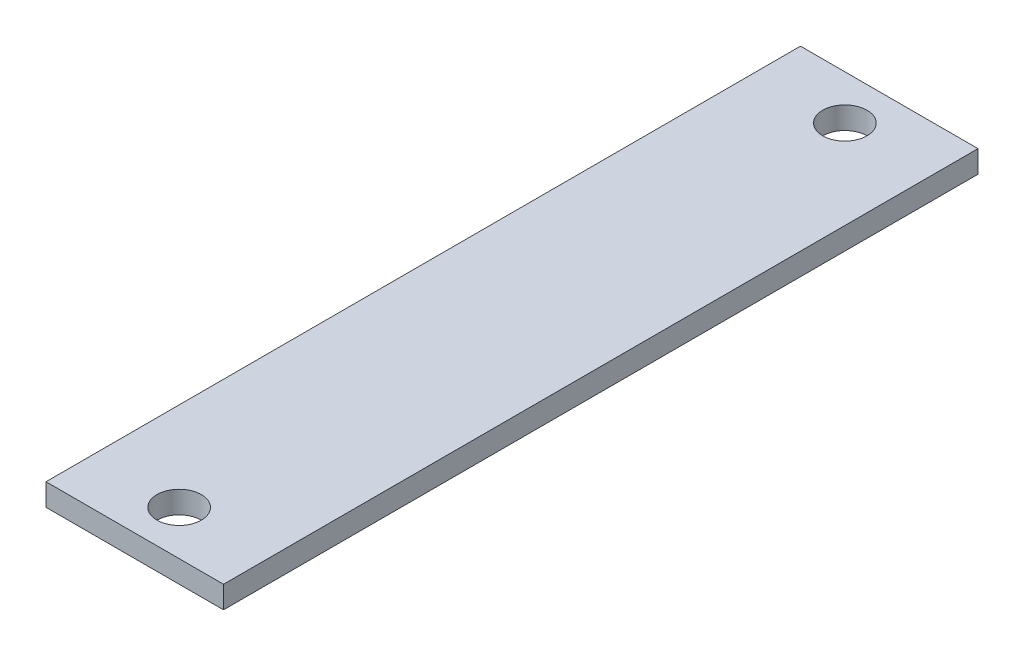
ISO-10303-21;
HEADER;
FILE_DESCRIPTION(('STEP AP214'),'2;1');
FILE_NAME('part.step','',(''),(''),'','','');
FILE_SCHEMA(('AUTOMOTIVE_DESIGN { 1 0 10303 214 1 1 1 1 }'));
ENDSEC;
DATA;
#1=APPLICATION_CONTEXT('core data for automotive mechanical design processes');
#2=APPLICATION_PROTOCOL_DEFINITION('international standard','automotive_design',2000,#1);
#3=PRODUCT_CONTEXT('',#1,'mechanical');
#4=PRODUCT('Part','Part','',(#3));
#5=PRODUCT_RELATED_PRODUCT_CATEGORY('part','',(#4));
#6=PRODUCT_DEFINITION_FORMATION('','',#4);
#7=PRODUCT_DEFINITION_CONTEXT('part definition',#1,'design');
#8=PRODUCT_DEFINITION('design','',#6,#7);
#9=PRODUCT_DEFINITION_SHAPE('','',#8);
#10=(LENGTH_UNIT() NAMED_UNIT(*) SI_UNIT(.MILLI.,.METRE.));
#11=(NAMED_UNIT(*) PLANE_ANGLE_UNIT() SI_UNIT($,.RADIAN.));
#12=(NAMED_UNIT(*) SI_UNIT($,.STERADIAN.) SOLID_ANGLE_UNIT());
#13=UNCERTAINTY_MEASURE_WITH_UNIT(LENGTH_MEASURE(1.E-05),#10,'distance_accuracy_value','');
#14=(GEOMETRIC_REPRESENTATION_CONTEXT(3) GLOBAL_UNCERTAINTY_ASSIGNED_CONTEXT((#13)) GLOBAL_UNIT_ASSIGNED_CONTEXT((#10,
#11,#12)) REPRESENTATION_CONTEXT('',''));
#15=CARTESIAN_POINT('',(0.,0.,0.));
#16=DIRECTION('',(0.,0.,1.));
#17=DIRECTION('',(1.,0.,0.));
#18=AXIS2_PLACEMENT_3D('',#15,#16,#17);
#19=CARTESIAN_POINT('',(-13.3421348080039,0.,51.6916067275177));
#20=DIRECTION('',(-1.,0.,0.));
#21=DIRECTION('',(0.,0.,1.));
#22=AXIS2_PLACEMENT_3D('',#19,#20,#21);
#23=PLANE('',#22);
#24=DIRECTION('',(0.,0.,-1.));
#25=VECTOR('',#24,1.);
#26=CARTESIAN_POINT('',(-13.3421348080039,-3.175,51.6916067275177));
#27=LINE('',#26,#25);
#28=CARTESIAN_POINT('',(-13.3421348080039,-3.175,51.6916067275177));
#29=VERTEX_POINT('',#28);
#30=CARTESIAN_POINT('',(-13.3421348080039,-3.175,-56.2583932724823));
#31=VERTEX_POINT('',#30);
#32=EDGE_CURVE('E114',#29,#31,#27,.T.);
#33=ORIENTED_EDGE('',*,*,#32,.F.);
#34=DIRECTION('',(0.,-1.,0.));
#35=VECTOR('',#34,1.);
#36=CARTESIAN_POINT('',(-13.3421348080039,0.,51.6916067275177));
#37=LINE('',#36,#35);
#38=CARTESIAN_POINT('',(-13.3421348080039,0.,51.6916067275177));
#39=VERTEX_POINT('',#38);
#40=EDGE_CURVE('E11',#39,#29,#37,.T.);
#41=ORIENTED_EDGE('',*,*,#40,.F.);
#42=DIRECTION('',(0.,0.,-1.));
#43=VECTOR('',#42,1.);
#44=CARTESIAN_POINT('',(-13.3421348080039,0.,51.6916067275177));
#45=LINE('',#44,#43);
#46=CARTESIAN_POINT('',(-13.3421348080039,0.,-56.2583932724823));
#47=VERTEX_POINT('',#46);
#48=EDGE_CURVE('E105',#39,#47,#45,.T.);
#49=ORIENTED_EDGE('',*,*,#48,.T.);
#50=DIRECTION('',(0.,-1.,0.));
#51=VECTOR('',#50,1.);
#52=CARTESIAN_POINT('',(-13.3421348080039,0.,-56.2583932724823));
#53=LINE('',#52,#51);
#54=EDGE_CURVE('E46',#47,#31,#53,.T.);
#55=ORIENTED_EDGE('',*,*,#54,.T.);
#56=EDGE_LOOP('',(#33,#41,#49,#55));
#57=FACE_BOUND('',#56,.T.);
#58=ADVANCED_FACE('F43',(#57),#23,.T.);
#59=CARTESIAN_POINT('',(12.0578651919961,0.,51.6916067275177));
#60=DIRECTION('',(0.,0.,1.));
#61=DIRECTION('',(1.,0.,0.));
#62=AXIS2_PLACEMENT_3D('',#59,#60,#61);
#63=PLANE('',#62);
#64=DIRECTION('',(-1.,0.,0.));
#65=VECTOR('',#64,1.);
#66=CARTESIAN_POINT('',(12.0578651919961,-3.175,51.6916067275177));
#67=LINE('',#66,#65);
#68=CARTESIAN_POINT('',(12.0578651919961,-3.175,51.6916067275177));
#69=VERTEX_POINT('',#68);
#70=EDGE_CURVE('E108',#69,#29,#67,.T.);
#71=ORIENTED_EDGE('',*,*,#70,.F.);
#72=DIRECTION('',(0.,-1.,0.));
#73=VECTOR('',#72,1.);
#74=CARTESIAN_POINT('',(12.0578651919961,0.,51.6916067275177));
#75=LINE('',#74,#73);
#76=CARTESIAN_POINT('',(12.0578651919961,0.,51.6916067275177));
#77=VERTEX_POINT('',#76);
#78=EDGE_CURVE('E53',#77,#69,#75,.T.);
#79=ORIENTED_EDGE('',*,*,#78,.F.);
#80=DIRECTION('',(-1.,0.,0.));
#81=VECTOR('',#80,1.);
#82=CARTESIAN_POINT('',(12.0578651919961,0.,51.6916067275177));
#83=LINE('',#82,#81);
#84=EDGE_CURVE('E100',#77,#39,#83,.T.);
#85=ORIENTED_EDGE('',*,*,#84,.T.);
#86=ORIENTED_EDGE('',*,*,#40,.T.);
#87=EDGE_LOOP('',(#71,#79,#85,#86));
#88=FACE_BOUND('',#87,.T.);
#89=ADVANCED_FACE('F131',(#88),#63,.T.);
#90=CARTESIAN_POINT('',(12.0578651919961,0.,-56.2583932724823));
#91=DIRECTION('',(1.,0.,0.));
#92=DIRECTION('',(0.,0.,-1.));
#93=AXIS2_PLACEMENT_3D('',#90,#91,#92);
#94=PLANE('',#93);
#95=DIRECTION('',(0.,0.,1.));
#96=VECTOR('',#95,1.);
#97=CARTESIAN_POINT('',(12.0578651919961,-3.175,-56.2583932724823));
#98=LINE('',#97,#96);
#99=CARTESIAN_POINT('',(12.0578651919961,-3.175,-56.2583932724823));
#100=VERTEX_POINT('',#99);
#101=EDGE_CURVE('E94',#100,#69,#98,.T.);
#102=ORIENTED_EDGE('',*,*,#101,.F.);
#103=DIRECTION('',(0.,-1.,0.));
#104=VECTOR('',#103,1.);
#105=CARTESIAN_POINT('',(12.0578651919961,0.,-56.2583932724823));
#106=LINE('',#105,#104);
#107=CARTESIAN_POINT('',(12.0578651919961,0.,-56.2583932724823));
#108=VERTEX_POINT('',#107);
#109=EDGE_CURVE('E89',#108,#100,#106,.T.);
#110=ORIENTED_EDGE('',*,*,#109,.F.);
#111=DIRECTION('',(0.,0.,1.));
#112=VECTOR('',#111,1.);
#113=CARTESIAN_POINT('',(12.0578651919961,0.,-56.2583932724823));
#114=LINE('',#113,#112);
#115=EDGE_CURVE('E92',#108,#77,#114,.T.);
#116=ORIENTED_EDGE('',*,*,#115,.T.);
#117=ORIENTED_EDGE('',*,*,#78,.T.);
#118=EDGE_LOOP('',(#102,#110,#116,#117));
#119=FACE_BOUND('',#118,.T.);
#120=ADVANCED_FACE('F91',(#119),#94,.T.);
#121=CARTESIAN_POINT('',(-13.3421348080039,0.,-56.2583932724823));
#122=DIRECTION('',(0.,0.,-1.));
#123=DIRECTION('',(-1.,0.,0.));
#124=AXIS2_PLACEMENT_3D('',#121,#122,#123);
#125=PLANE('',#124);
#126=DIRECTION('',(1.,0.,0.));
#127=VECTOR('',#126,1.);
#128=CARTESIAN_POINT('',(-13.3421348080039,-3.175,-56.2583932724823));
#129=LINE('',#128,#127);
#130=EDGE_CURVE('E118',#31,#100,#129,.T.);
#131=ORIENTED_EDGE('',*,*,#130,.F.);
#132=ORIENTED_EDGE('',*,*,#54,.F.);
#133=DIRECTION('',(1.,0.,0.));
#134=VECTOR('',#133,1.);
#135=CARTESIAN_POINT('',(-13.3421348080039,0.,-56.2583932724823));
#136=LINE('',#135,#134);
#137=EDGE_CURVE('E99',#47,#108,#136,.T.);
#138=ORIENTED_EDGE('',*,*,#137,.T.);
#139=ORIENTED_EDGE('',*,*,#109,.T.);
#140=EDGE_LOOP('',(#131,#132,#138,#139));
#141=FACE_BOUND('',#140,.T.);
#142=ADVANCED_FACE('F103',(#141),#125,.T.);
#143=CARTESIAN_POINT('',(0.,0.,0.));
#144=DIRECTION('',(0.,-1.,0.));
#145=DIRECTION('',(0.,0.,-1.));
#146=AXIS2_PLACEMENT_3D('',#143,#144,#145);
#147=PLANE('',#146);
#148=CARTESIAN_POINT('',(-0.642134808003898,0.,45.3416067275177));
#149=DIRECTION('',(0.,-1.,0.));
#150=DIRECTION('',(0.,0.,1.));
#151=AXIS2_PLACEMENT_3D('',#148,#149,#150);
#152=CIRCLE('',#151,3.175);
#153=CARTESIAN_POINT('',(-0.642134808003898,0.,48.5166067275177));
#154=VERTEX_POINT('',#153);
#155=EDGE_CURVE('E164',#154,#154,#152,.T.);
#156=ORIENTED_EDGE('',*,*,#155,.T.);
#157=EDGE_LOOP('',(#156));
#158=FACE_BOUND('',#157,.T.);
#159=CARTESIAN_POINT('',(-0.642134808003904,0.,-49.9083932724823));
#160=DIRECTION('',(0.,-1.,0.));
#161=DIRECTION('',(0.,0.,1.));
#162=AXIS2_PLACEMENT_3D('',#159,#160,#161);
#163=CIRCLE('',#162,3.175);
#164=CARTESIAN_POINT('',(-0.642134808003904,0.,-46.7333932724823));
#165=VERTEX_POINT('',#164);
#166=EDGE_CURVE('E119',#165,#165,#163,.T.);
#167=ORIENTED_EDGE('',*,*,#166,.T.);
#168=EDGE_LOOP('',(#167));
#169=FACE_BOUND('',#168,.T.);
#170=ORIENTED_EDGE('',*,*,#48,.F.);
#171=ORIENTED_EDGE('',*,*,#84,.F.);
#172=ORIENTED_EDGE('',*,*,#115,.F.);
#173=ORIENTED_EDGE('',*,*,#137,.F.);
#174=EDGE_LOOP('',(#170,#171,#172,#173));
#175=FACE_BOUND('',#174,.T.);
#176=ADVANCED_FACE('F98',(#158,#169,#175),#147,.F.);
#177=CARTESIAN_POINT('',(0.,-3.175,0.));
#178=DIRECTION('',(0.,-1.,0.));
#179=DIRECTION('',(0.,0.,-1.));
#180=AXIS2_PLACEMENT_3D('',#177,#178,#179);
#181=PLANE('',#180);
#182=CARTESIAN_POINT('',(-0.642134808003898,-3.175,45.3416067275177));
#183=DIRECTION('',(0.,-1.,0.));
#184=DIRECTION('',(0.,0.,1.));
#185=AXIS2_PLACEMENT_3D('',#182,#183,#184);
#186=CIRCLE('',#185,3.175);
#187=CARTESIAN_POINT('',(-0.642134808003898,-3.175,48.5166067275177));
#188=VERTEX_POINT('',#187);
#189=EDGE_CURVE('E167',#188,#188,#186,.T.);
#190=ORIENTED_EDGE('',*,*,#189,.F.);
#191=EDGE_LOOP('',(#190));
#192=FACE_BOUND('',#191,.T.);
#193=CARTESIAN_POINT('',(-0.642134808003904,-3.175,-49.9083932724823));
#194=DIRECTION('',(0.,-1.,0.));
#195=DIRECTION('',(0.,0.,1.));
#196=AXIS2_PLACEMENT_3D('',#193,#194,#195);
#197=CIRCLE('',#196,3.175);
#198=CARTESIAN_POINT('',(-0.642134808003904,-3.175,-46.7333932724823));
#199=VERTEX_POINT('',#198);
#200=EDGE_CURVE('E171',#199,#199,#197,.T.);
#201=ORIENTED_EDGE('',*,*,#200,.F.);
#202=EDGE_LOOP('',(#201));
#203=FACE_BOUND('',#202,.T.);
#204=ORIENTED_EDGE('',*,*,#32,.T.);
#205=ORIENTED_EDGE('',*,*,#130,.T.);
#206=ORIENTED_EDGE('',*,*,#101,.T.);
#207=ORIENTED_EDGE('',*,*,#70,.T.);
#208=EDGE_LOOP('',(#204,#205,#206,#207));
#209=FACE_BOUND('',#208,.T.);
#210=ADVANCED_FACE('F130',(#192,#203,#209),#181,.T.);
#211=CARTESIAN_POINT('',(-0.642134808003904,0.,-49.9083932724823));
#212=DIRECTION('',(0.,-1.,0.));
#213=DIRECTION('',(0.,0.,-1.));
#214=AXIS2_PLACEMENT_3D('',#211,#212,#213);
#215=CYLINDRICAL_SURFACE('',#214,3.175);
#216=ORIENTED_EDGE('',*,*,#166,.F.);
#217=EDGE_LOOP('',(#216));
#218=FACE_BOUND('',#217,.T.);
#219=ORIENTED_EDGE('',*,*,#200,.T.);
#220=EDGE_LOOP('',(#219));
#221=FACE_BOUND('',#220,.T.);
#222=ADVANCED_FACE('F149',(#218,#221),#215,.F.);
#223=CARTESIAN_POINT('',(-0.642134808003898,0.,45.3416067275177));
#224=DIRECTION('',(0.,-1.,0.));
#225=DIRECTION('',(0.,0.,-1.));
#226=AXIS2_PLACEMENT_3D('',#223,#224,#225);
#227=CYLINDRICAL_SURFACE('',#226,3.175);
#228=ORIENTED_EDGE('',*,*,#155,.F.);
#229=EDGE_LOOP('',(#228));
#230=FACE_BOUND('',#229,.T.);
#231=ORIENTED_EDGE('',*,*,#189,.T.);
#232=EDGE_LOOP('',(#231));
#233=FACE_BOUND('',#232,.T.);
#234=ADVANCED_FACE('F156',(#230,#233),#227,.F.);
#235=CLOSED_SHELL('',(#58,#89,#120,#142,#176,#210,#222,#234));
#236=MANIFOLD_SOLID_BREP('B2',#235);
#237=ADVANCED_BREP_SHAPE_REPRESENTATION('',(#18,#236),#14);
#238=SHAPE_DEFINITION_REPRESENTATION(#9,#237);
ENDSEC;
END-ISO-10303-21;
